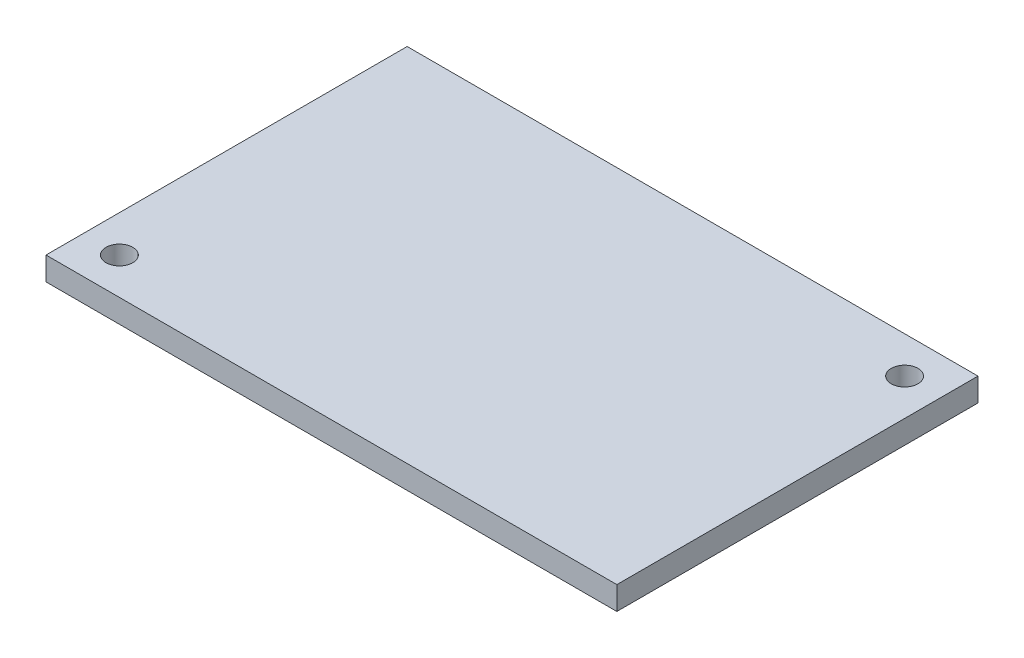
ISO-10303-21;
HEADER;
FILE_DESCRIPTION(('STEP AP214'),'2;1');
FILE_NAME('part.step','',(''),(''),'','','');
FILE_SCHEMA(('AUTOMOTIVE_DESIGN { 1 0 10303 214 1 1 1 1 }'));
ENDSEC;
DATA;
#1=APPLICATION_CONTEXT('core data for automotive mechanical design processes');
#2=APPLICATION_PROTOCOL_DEFINITION('international standard','automotive_design',2000,#1);
#3=PRODUCT_CONTEXT('',#1,'mechanical');
#4=PRODUCT('Part','Part','',(#3));
#5=PRODUCT_RELATED_PRODUCT_CATEGORY('part','',(#4));
#6=PRODUCT_DEFINITION_FORMATION('','',#4);
#7=PRODUCT_DEFINITION_CONTEXT('part definition',#1,'design');
#8=PRODUCT_DEFINITION('design','',#6,#7);
#9=PRODUCT_DEFINITION_SHAPE('','',#8);
#10=(LENGTH_UNIT() NAMED_UNIT(*) SI_UNIT(.MILLI.,.METRE.));
#11=(NAMED_UNIT(*) PLANE_ANGLE_UNIT() SI_UNIT($,.RADIAN.));
#12=(NAMED_UNIT(*) SI_UNIT($,.STERADIAN.) SOLID_ANGLE_UNIT());
#13=UNCERTAINTY_MEASURE_WITH_UNIT(LENGTH_MEASURE(1.E-05),#10,'distance_accuracy_value','');
#14=(GEOMETRIC_REPRESENTATION_CONTEXT(3) GLOBAL_UNCERTAINTY_ASSIGNED_CONTEXT((#13)) GLOBAL_UNIT_ASSIGNED_CONTEXT((#10,
#11,#12)) REPRESENTATION_CONTEXT('',''));
#15=CARTESIAN_POINT('',(0.,0.,0.));
#16=DIRECTION('',(0.,0.,1.));
#17=DIRECTION('',(1.,0.,0.));
#18=AXIS2_PLACEMENT_3D('',#15,#16,#17);
#19=CARTESIAN_POINT('',(0.,0.,-39.37));
#20=DIRECTION('',(-1.,0.,0.));
#21=DIRECTION('',(0.,0.,1.));
#22=AXIS2_PLACEMENT_3D('',#19,#20,#21);
#23=PLANE('',#22);
#24=DIRECTION('',(0.,-1.,0.));
#25=VECTOR('',#24,1.);
#26=CARTESIAN_POINT('',(0.,0.,0.));
#27=LINE('',#26,#25);
#28=CARTESIAN_POINT('',(0.,2.54,0.));
#29=VERTEX_POINT('',#28);
#30=CARTESIAN_POINT('',(0.,0.,0.));
#31=VERTEX_POINT('',#30);
#32=EDGE_CURVE('E98',#29,#31,#27,.T.);
#33=ORIENTED_EDGE('',*,*,#32,.F.);
#34=DIRECTION('',(0.,0.,1.));
#35=VECTOR('',#34,1.);
#36=CARTESIAN_POINT('',(0.,2.54,-39.37));
#37=LINE('',#36,#35);
#38=CARTESIAN_POINT('',(0.,2.54,-39.37));
#39=VERTEX_POINT('',#38);
#40=EDGE_CURVE('E11',#39,#29,#37,.T.);
#41=ORIENTED_EDGE('',*,*,#40,.F.);
#42=DIRECTION('',(0.,-1.,0.));
#43=VECTOR('',#42,1.);
#44=CARTESIAN_POINT('',(0.,0.,-39.37));
#45=LINE('',#44,#43);
#46=CARTESIAN_POINT('',(0.,0.,-39.37));
#47=VERTEX_POINT('',#46);
#48=EDGE_CURVE('E91',#39,#47,#45,.T.);
#49=ORIENTED_EDGE('',*,*,#48,.T.);
#50=DIRECTION('',(0.,0.,1.));
#51=VECTOR('',#50,1.);
#52=CARTESIAN_POINT('',(0.,0.,-39.37));
#53=LINE('',#52,#51);
#54=EDGE_CURVE('E36',#47,#31,#53,.T.);
#55=ORIENTED_EDGE('',*,*,#54,.T.);
#56=EDGE_LOOP('',(#33,#41,#49,#55));
#57=FACE_BOUND('',#56,.T.);
#58=ADVANCED_FACE('F33',(#57),#23,.T.);
#59=CARTESIAN_POINT('',(0.,2.54,-39.37));
#60=DIRECTION('',(0.,1.,0.));
#61=DIRECTION('',(0.,0.,1.));
#62=AXIS2_PLACEMENT_3D('',#59,#60,#61);
#63=PLANE('',#62);
#64=CARTESIAN_POINT('',(4.0005,2.54,-4.0005));
#65=DIRECTION('',(0.,1.,0.));
#66=DIRECTION('',(0.,0.,1.));
#67=AXIS2_PLACEMENT_3D('',#64,#65,#66);
#68=CIRCLE('',#67,1.4605);
#69=CARTESIAN_POINT('',(4.0005,2.54,-2.54));
#70=VERTEX_POINT('',#69);
#71=EDGE_CURVE('E134',#70,#70,#68,.T.);
#72=ORIENTED_EDGE('',*,*,#71,.F.);
#73=EDGE_LOOP('',(#72));
#74=FACE_BOUND('',#73,.T.);
#75=CARTESIAN_POINT('',(58.2295,2.54,-35.3695));
#76=DIRECTION('',(0.,1.,0.));
#77=DIRECTION('',(0.,0.,1.));
#78=AXIS2_PLACEMENT_3D('',#75,#76,#77);
#79=CIRCLE('',#78,1.4605);
#80=CARTESIAN_POINT('',(58.2295,2.54,-33.909));
#81=VERTEX_POINT('',#80);
#82=EDGE_CURVE('E135',#81,#81,#79,.T.);
#83=ORIENTED_EDGE('',*,*,#82,.F.);
#84=EDGE_LOOP('',(#83));
#85=FACE_BOUND('',#84,.T.);
#86=DIRECTION('',(-1.,0.,0.));
#87=VECTOR('',#86,1.);
#88=CARTESIAN_POINT('',(0.,2.54,0.));
#89=LINE('',#88,#87);
#90=CARTESIAN_POINT('',(62.23,2.54,0.));
#91=VERTEX_POINT('',#90);
#92=EDGE_CURVE('E93',#91,#29,#89,.T.);
#93=ORIENTED_EDGE('',*,*,#92,.F.);
#94=DIRECTION('',(0.,0.,1.));
#95=VECTOR('',#94,1.);
#96=CARTESIAN_POINT('',(62.23,2.54,-39.37));
#97=LINE('',#96,#95);
#98=CARTESIAN_POINT('',(62.23,2.54,-39.37));
#99=VERTEX_POINT('',#98);
#100=EDGE_CURVE('E42',#99,#91,#97,.T.);
#101=ORIENTED_EDGE('',*,*,#100,.F.);
#102=DIRECTION('',(-1.,0.,0.));
#103=VECTOR('',#102,1.);
#104=CARTESIAN_POINT('',(0.,2.54,-39.37));
#105=LINE('',#104,#103);
#106=EDGE_CURVE('E88',#99,#39,#105,.T.);
#107=ORIENTED_EDGE('',*,*,#106,.T.);
#108=ORIENTED_EDGE('',*,*,#40,.T.);
#109=EDGE_LOOP('',(#93,#101,#107,#108));
#110=FACE_BOUND('',#109,.T.);
#111=ADVANCED_FACE('F109',(#74,#85,#110),#63,.T.);
#112=CARTESIAN_POINT('',(62.23,0.,-39.37));
#113=DIRECTION('',(1.,0.,0.));
#114=DIRECTION('',(0.,0.,-1.));
#115=AXIS2_PLACEMENT_3D('',#112,#113,#114);
#116=PLANE('',#115);
#117=DIRECTION('',(0.,1.,0.));
#118=VECTOR('',#117,1.);
#119=CARTESIAN_POINT('',(62.23,0.,0.));
#120=LINE('',#119,#118);
#121=CARTESIAN_POINT('',(62.23,0.,0.));
#122=VERTEX_POINT('',#121);
#123=EDGE_CURVE('E83',#122,#91,#120,.T.);
#124=ORIENTED_EDGE('',*,*,#123,.F.);
#125=DIRECTION('',(0.,0.,1.));
#126=VECTOR('',#125,1.);
#127=CARTESIAN_POINT('',(62.23,0.,-39.37));
#128=LINE('',#127,#126);
#129=CARTESIAN_POINT('',(62.23,0.,-39.37));
#130=VERTEX_POINT('',#129);
#131=EDGE_CURVE('E78',#130,#122,#128,.T.);
#132=ORIENTED_EDGE('',*,*,#131,.F.);
#133=DIRECTION('',(0.,1.,0.));
#134=VECTOR('',#133,1.);
#135=CARTESIAN_POINT('',(62.23,0.,-39.37));
#136=LINE('',#135,#134);
#137=EDGE_CURVE('E81',#130,#99,#136,.T.);
#138=ORIENTED_EDGE('',*,*,#137,.T.);
#139=ORIENTED_EDGE('',*,*,#100,.T.);
#140=EDGE_LOOP('',(#124,#132,#138,#139));
#141=FACE_BOUND('',#140,.T.);
#142=ADVANCED_FACE('F80',(#141),#116,.T.);
#143=CARTESIAN_POINT('',(0.,0.,-39.37));
#144=DIRECTION('',(0.,-1.,0.));
#145=DIRECTION('',(0.,0.,-1.));
#146=AXIS2_PLACEMENT_3D('',#143,#144,#145);
#147=PLANE('',#146);
#148=CARTESIAN_POINT('',(4.0005,0.,-4.0005));
#149=DIRECTION('',(0.,1.,0.));
#150=DIRECTION('',(0.,0.,1.));
#151=AXIS2_PLACEMENT_3D('',#148,#149,#150);
#152=CIRCLE('',#151,1.4605);
#153=CARTESIAN_POINT('',(4.0005,0.,-2.54));
#154=VERTEX_POINT('',#153);
#155=EDGE_CURVE('E102',#154,#154,#152,.T.);
#156=ORIENTED_EDGE('',*,*,#155,.T.);
#157=EDGE_LOOP('',(#156));
#158=FACE_BOUND('',#157,.T.);
#159=CARTESIAN_POINT('',(58.2295,0.,-35.3695));
#160=DIRECTION('',(0.,1.,0.));
#161=DIRECTION('',(0.,0.,1.));
#162=AXIS2_PLACEMENT_3D('',#159,#160,#161);
#163=CIRCLE('',#162,1.4605);
#164=CARTESIAN_POINT('',(58.2295,0.,-33.909));
#165=VERTEX_POINT('',#164);
#166=EDGE_CURVE('E132',#165,#165,#163,.T.);
#167=ORIENTED_EDGE('',*,*,#166,.T.);
#168=EDGE_LOOP('',(#167));
#169=FACE_BOUND('',#168,.T.);
#170=DIRECTION('',(1.,0.,0.));
#171=VECTOR('',#170,1.);
#172=CARTESIAN_POINT('',(0.,0.,0.));
#173=LINE('',#172,#171);
#174=EDGE_CURVE('E101',#31,#122,#173,.T.);
#175=ORIENTED_EDGE('',*,*,#174,.F.);
#176=ORIENTED_EDGE('',*,*,#54,.F.);
#177=DIRECTION('',(1.,0.,0.));
#178=VECTOR('',#177,1.);
#179=CARTESIAN_POINT('',(0.,0.,-39.37));
#180=LINE('',#179,#178);
#181=EDGE_CURVE('E87',#47,#130,#180,.T.);
#182=ORIENTED_EDGE('',*,*,#181,.T.);
#183=ORIENTED_EDGE('',*,*,#131,.T.);
#184=EDGE_LOOP('',(#175,#176,#182,#183));
#185=FACE_BOUND('',#184,.T.);
#186=ADVANCED_FACE('F90',(#158,#169,#185),#147,.T.);
#187=CARTESIAN_POINT('',(0.,0.,-39.37));
#188=DIRECTION('',(0.,0.,-1.));
#189=DIRECTION('',(-1.,0.,0.));
#190=AXIS2_PLACEMENT_3D('',#187,#188,#189);
#191=PLANE('',#190);
#192=ORIENTED_EDGE('',*,*,#48,.F.);
#193=ORIENTED_EDGE('',*,*,#106,.F.);
#194=ORIENTED_EDGE('',*,*,#137,.F.);
#195=ORIENTED_EDGE('',*,*,#181,.F.);
#196=EDGE_LOOP('',(#192,#193,#194,#195));
#197=FACE_BOUND('',#196,.T.);
#198=ADVANCED_FACE('F86',(#197),#191,.T.);
#199=CARTESIAN_POINT('',(0.,0.,0.));
#200=DIRECTION('',(0.,0.,-1.));
#201=DIRECTION('',(-1.,0.,0.));
#202=AXIS2_PLACEMENT_3D('',#199,#200,#201);
#203=PLANE('',#202);
#204=ORIENTED_EDGE('',*,*,#32,.T.);
#205=ORIENTED_EDGE('',*,*,#174,.T.);
#206=ORIENTED_EDGE('',*,*,#123,.T.);
#207=ORIENTED_EDGE('',*,*,#92,.T.);
#208=EDGE_LOOP('',(#204,#205,#206,#207));
#209=FACE_BOUND('',#208,.T.);
#210=ADVANCED_FACE('F108',(#209),#203,.F.);
#211=CARTESIAN_POINT('',(58.2295,0.,-35.3695));
#212=DIRECTION('',(0.,1.,0.));
#213=DIRECTION('',(0.,0.,1.));
#214=AXIS2_PLACEMENT_3D('',#211,#212,#213);
#215=CYLINDRICAL_SURFACE('',#214,1.4605);
#216=ORIENTED_EDGE('',*,*,#166,.F.);
#217=EDGE_LOOP('',(#216));
#218=FACE_BOUND('',#217,.T.);
#219=ORIENTED_EDGE('',*,*,#82,.T.);
#220=EDGE_LOOP('',(#219));
#221=FACE_BOUND('',#220,.T.);
#222=ADVANCED_FACE('F143',(#218,#221),#215,.F.);
#223=CARTESIAN_POINT('',(4.0005,0.,-4.0005));
#224=DIRECTION('',(0.,1.,0.));
#225=DIRECTION('',(0.,0.,1.));
#226=AXIS2_PLACEMENT_3D('',#223,#224,#225);
#227=CYLINDRICAL_SURFACE('',#226,1.4605);
#228=ORIENTED_EDGE('',*,*,#155,.F.);
#229=EDGE_LOOP('',(#228));
#230=FACE_BOUND('',#229,.T.);
#231=ORIENTED_EDGE('',*,*,#71,.T.);
#232=EDGE_LOOP('',(#231));
#233=FACE_BOUND('',#232,.T.);
#234=ADVANCED_FACE('F145',(#230,#233),#227,.F.);
#235=CLOSED_SHELL('',(#58,#111,#142,#186,#198,#210,#222,#234));
#236=MANIFOLD_SOLID_BREP('B2',#235);
#237=ADVANCED_BREP_SHAPE_REPRESENTATION('',(#18,#236),#14);
#238=SHAPE_DEFINITION_REPRESENTATION(#9,#237);
ENDSEC;
END-ISO-10303-21;
